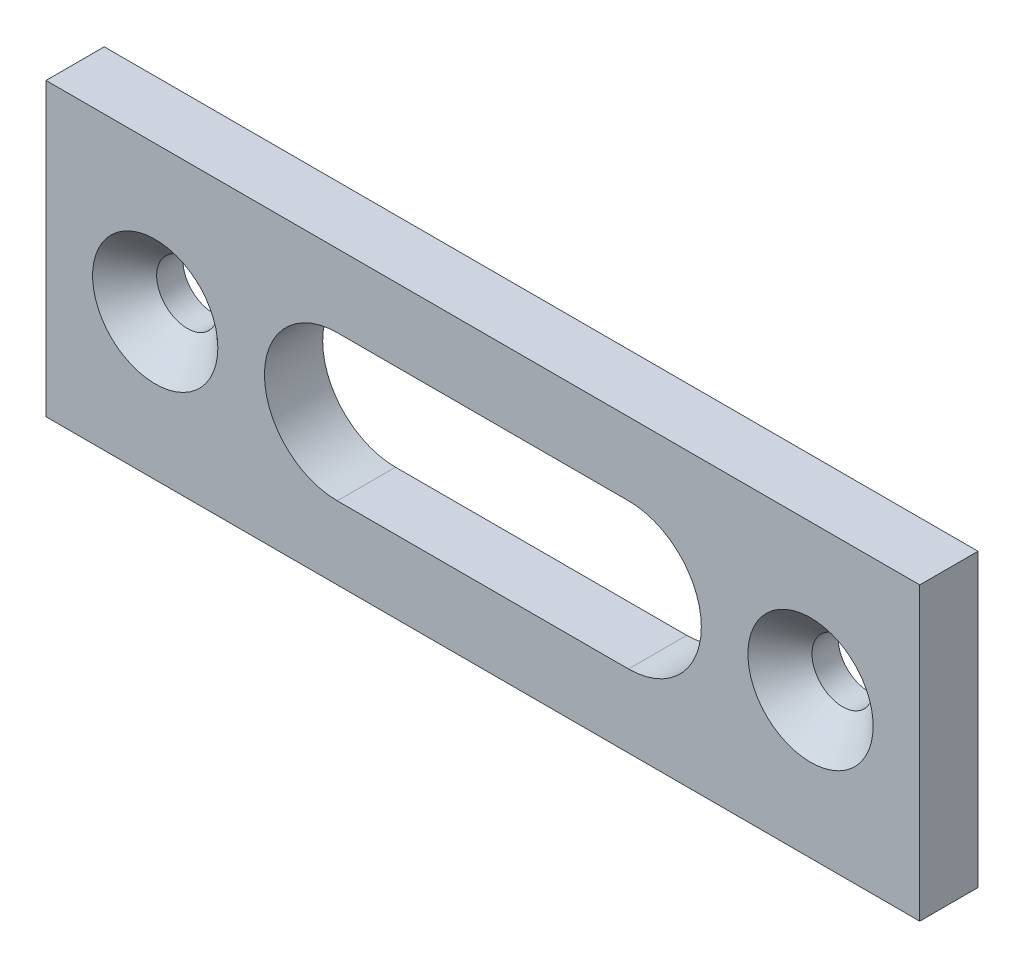
ISO-10303-21;
HEADER;
FILE_DESCRIPTION(('STEP AP214'),'2;1');
FILE_NAME('part.step','',(''),(''),'','','');
FILE_SCHEMA(('AUTOMOTIVE_DESIGN { 1 0 10303 214 1 1 1 1 }'));
ENDSEC;
DATA;
#1=APPLICATION_CONTEXT('core data for automotive mechanical design processes');
#2=APPLICATION_PROTOCOL_DEFINITION('international standard','automotive_design',2000,#1);
#3=PRODUCT_CONTEXT('',#1,'mechanical');
#4=PRODUCT('Part','Part','',(#3));
#5=PRODUCT_RELATED_PRODUCT_CATEGORY('part','',(#4));
#6=PRODUCT_DEFINITION_FORMATION('','',#4);
#7=PRODUCT_DEFINITION_CONTEXT('part definition',#1,'design');
#8=PRODUCT_DEFINITION('design','',#6,#7);
#9=PRODUCT_DEFINITION_SHAPE('','',#8);
#10=(LENGTH_UNIT() NAMED_UNIT(*) SI_UNIT(.MILLI.,.METRE.));
#11=(NAMED_UNIT(*) PLANE_ANGLE_UNIT() SI_UNIT($,.RADIAN.));
#12=(NAMED_UNIT(*) SI_UNIT($,.STERADIAN.) SOLID_ANGLE_UNIT());
#13=UNCERTAINTY_MEASURE_WITH_UNIT(LENGTH_MEASURE(1.E-05),#10,'distance_accuracy_value','');
#14=(GEOMETRIC_REPRESENTATION_CONTEXT(3) GLOBAL_UNCERTAINTY_ASSIGNED_CONTEXT((#13)) GLOBAL_UNIT_ASSIGNED_CONTEXT((#10,
#11,#12)) REPRESENTATION_CONTEXT('',''));
#15=CARTESIAN_POINT('',(0.,0.,0.));
#16=DIRECTION('',(0.,0.,1.));
#17=DIRECTION('',(1.,0.,0.));
#18=AXIS2_PLACEMENT_3D('',#15,#16,#17);
#19=CARTESIAN_POINT('',(-30.,-10.,4.));
#20=DIRECTION('',(0.,0.,1.));
#21=DIRECTION('',(1.,0.,0.));
#22=AXIS2_PLACEMENT_3D('',#19,#20,#21);
#23=PLANE('',#22);
#24=CARTESIAN_POINT('',(22.5,0.,4.));
#25=DIRECTION('',(0.,0.,1.));
#26=DIRECTION('',(1.,0.,0.));
#27=AXIS2_PLACEMENT_3D('',#24,#25,#26);
#28=CIRCLE('',#27,4.30000000000001);
#29=CARTESIAN_POINT('',(26.8,0.,4.));
#30=VERTEX_POINT('',#29);
#31=EDGE_CURVE('E34',#30,#30,#28,.F.);
#32=ORIENTED_EDGE('',*,*,#31,.T.);
#33=EDGE_LOOP('',(#32));
#34=FACE_BOUND('',#33,.T.);
#35=CARTESIAN_POINT('',(-22.5,0.,4.));
#36=DIRECTION('',(0.,0.,1.));
#37=DIRECTION('',(1.,0.,0.));
#38=AXIS2_PLACEMENT_3D('',#35,#36,#37);
#39=CIRCLE('',#38,4.30000000000001);
#40=CARTESIAN_POINT('',(-18.2,0.,4.));
#41=VERTEX_POINT('',#40);
#42=EDGE_CURVE('E165',#41,#41,#39,.F.);
#43=ORIENTED_EDGE('',*,*,#42,.T.);
#44=EDGE_LOOP('',(#43));
#45=FACE_BOUND('',#44,.T.);
#46=DIRECTION('',(0.,-1.,0.));
#47=VECTOR('',#46,1.);
#48=CARTESIAN_POINT('',(-30.,9.99999999999999,4.));
#49=LINE('',#48,#47);
#50=CARTESIAN_POINT('',(-30.,9.99999999999999,4.));
#51=VERTEX_POINT('',#50);
#52=CARTESIAN_POINT('',(-30.,-10.,4.));
#53=VERTEX_POINT('',#52);
#54=EDGE_CURVE('E141',#51,#53,#49,.T.);
#55=ORIENTED_EDGE('',*,*,#54,.T.);
#56=DIRECTION('',(1.,0.,0.));
#57=VECTOR('',#56,1.);
#58=CARTESIAN_POINT('',(-30.,-10.,4.));
#59=LINE('',#58,#57);
#60=CARTESIAN_POINT('',(30.,-9.99999999999999,4.));
#61=VERTEX_POINT('',#60);
#62=EDGE_CURVE('E144',#53,#61,#59,.T.);
#63=ORIENTED_EDGE('',*,*,#62,.T.);
#64=DIRECTION('',(0.,1.,0.));
#65=VECTOR('',#64,1.);
#66=CARTESIAN_POINT('',(30.,10.,4.));
#67=LINE('',#66,#65);
#68=CARTESIAN_POINT('',(30.,10.,4.));
#69=VERTEX_POINT('',#68);
#70=EDGE_CURVE('E146',#61,#69,#67,.T.);
#71=ORIENTED_EDGE('',*,*,#70,.T.);
#72=DIRECTION('',(-1.,0.,0.));
#73=VECTOR('',#72,1.);
#74=CARTESIAN_POINT('',(-30.,9.99999999999999,4.));
#75=LINE('',#74,#73);
#76=EDGE_CURVE('E148',#69,#51,#75,.T.);
#77=ORIENTED_EDGE('',*,*,#76,.T.);
#78=EDGE_LOOP('',(#55,#63,#71,#77));
#79=FACE_BOUND('',#78,.T.);
#80=DIRECTION('',(1.,0.,0.));
#81=VECTOR('',#80,1.);
#82=CARTESIAN_POINT('',(-9.99999999999999,-5.,4.));
#83=LINE('',#82,#81);
#84=CARTESIAN_POINT('',(-9.99999999999999,-5.,4.));
#85=VERTEX_POINT('',#84);
#86=CARTESIAN_POINT('',(10.,-5.,4.));
#87=VERTEX_POINT('',#86);
#88=EDGE_CURVE('E117',#85,#87,#83,.T.);
#89=ORIENTED_EDGE('',*,*,#88,.F.);
#90=CARTESIAN_POINT('',(-9.99999999999999,0.,4.));
#91=DIRECTION('',(0.,0.,1.));
#92=DIRECTION('',(1.,0.,0.));
#93=AXIS2_PLACEMENT_3D('',#90,#91,#92);
#94=CIRCLE('',#93,5.);
#95=CARTESIAN_POINT('',(-9.99999999999999,5.,4.));
#96=VERTEX_POINT('',#95);
#97=EDGE_CURVE('E106',#96,#85,#94,.T.);
#98=ORIENTED_EDGE('',*,*,#97,.F.);
#99=DIRECTION('',(-1.,0.,0.));
#100=VECTOR('',#99,1.);
#101=CARTESIAN_POINT('',(-9.99999999999999,5.,4.));
#102=LINE('',#101,#100);
#103=CARTESIAN_POINT('',(10.,5.,4.));
#104=VERTEX_POINT('',#103);
#105=EDGE_CURVE('E121',#104,#96,#102,.T.);
#106=ORIENTED_EDGE('',*,*,#105,.F.);
#107=CARTESIAN_POINT('',(10.,0.,4.));
#108=DIRECTION('',(0.,0.,1.));
#109=DIRECTION('',(1.,0.,0.));
#110=AXIS2_PLACEMENT_3D('',#107,#108,#109);
#111=CIRCLE('',#110,5.);
#112=EDGE_CURVE('E119',#87,#104,#111,.T.);
#113=ORIENTED_EDGE('',*,*,#112,.F.);
#114=EDGE_LOOP('',(#89,#98,#106,#113));
#115=FACE_BOUND('',#114,.T.);
#116=ADVANCED_FACE('F26',(#34,#45,#79,#115),#23,.T.);
#117=CARTESIAN_POINT('',(-30.,-10.,0.));
#118=DIRECTION('',(0.,0.,1.));
#119=DIRECTION('',(1.,0.,0.));
#120=AXIS2_PLACEMENT_3D('',#117,#118,#119);
#121=PLANE('',#120);
#122=CARTESIAN_POINT('',(22.5,0.,0.));
#123=DIRECTION('',(0.,0.,1.));
#124=DIRECTION('',(1.,0.,0.));
#125=AXIS2_PLACEMENT_3D('',#122,#123,#124);
#126=CIRCLE('',#125,2.1);
#127=CARTESIAN_POINT('',(24.6,0.,0.));
#128=VERTEX_POINT('',#127);
#129=EDGE_CURVE('E107',#128,#128,#126,.T.);
#130=ORIENTED_EDGE('',*,*,#129,.T.);
#131=EDGE_LOOP('',(#130));
#132=FACE_BOUND('',#131,.T.);
#133=DIRECTION('',(0.,-1.,0.));
#134=VECTOR('',#133,1.);
#135=CARTESIAN_POINT('',(-30.,9.99999999999999,0.));
#136=LINE('',#135,#134);
#137=CARTESIAN_POINT('',(-30.,9.99999999999999,0.));
#138=VERTEX_POINT('',#137);
#139=CARTESIAN_POINT('',(-30.,-10.,0.));
#140=VERTEX_POINT('',#139);
#141=EDGE_CURVE('E132',#138,#140,#136,.T.);
#142=ORIENTED_EDGE('',*,*,#141,.F.);
#143=DIRECTION('',(-1.,0.,0.));
#144=VECTOR('',#143,1.);
#145=CARTESIAN_POINT('',(-30.,9.99999999999999,0.));
#146=LINE('',#145,#144);
#147=CARTESIAN_POINT('',(30.,10.,0.));
#148=VERTEX_POINT('',#147);
#149=EDGE_CURVE('E139',#148,#138,#146,.T.);
#150=ORIENTED_EDGE('',*,*,#149,.F.);
#151=DIRECTION('',(0.,1.,0.));
#152=VECTOR('',#151,1.);
#153=CARTESIAN_POINT('',(30.,10.,0.));
#154=LINE('',#153,#152);
#155=CARTESIAN_POINT('',(30.,-9.99999999999999,0.));
#156=VERTEX_POINT('',#155);
#157=EDGE_CURVE('E137',#156,#148,#154,.T.);
#158=ORIENTED_EDGE('',*,*,#157,.F.);
#159=DIRECTION('',(1.,0.,0.));
#160=VECTOR('',#159,1.);
#161=CARTESIAN_POINT('',(-30.,-10.,0.));
#162=LINE('',#161,#160);
#163=EDGE_CURVE('E135',#140,#156,#162,.T.);
#164=ORIENTED_EDGE('',*,*,#163,.F.);
#165=EDGE_LOOP('',(#142,#150,#158,#164));
#166=FACE_BOUND('',#165,.T.);
#167=CARTESIAN_POINT('',(-22.5,0.,0.));
#168=DIRECTION('',(0.,0.,1.));
#169=DIRECTION('',(1.,0.,0.));
#170=AXIS2_PLACEMENT_3D('',#167,#168,#169);
#171=CIRCLE('',#170,2.1);
#172=CARTESIAN_POINT('',(-20.4,0.,0.));
#173=VERTEX_POINT('',#172);
#174=EDGE_CURVE('E129',#173,#173,#171,.T.);
#175=ORIENTED_EDGE('',*,*,#174,.T.);
#176=EDGE_LOOP('',(#175));
#177=FACE_BOUND('',#176,.T.);
#178=CARTESIAN_POINT('',(-9.99999999999999,0.,0.));
#179=DIRECTION('',(0.,0.,1.));
#180=DIRECTION('',(1.,0.,0.));
#181=AXIS2_PLACEMENT_3D('',#178,#179,#180);
#182=CIRCLE('',#181,5.);
#183=CARTESIAN_POINT('',(-9.99999999999999,5.,0.));
#184=VERTEX_POINT('',#183);
#185=CARTESIAN_POINT('',(-9.99999999999999,-5.,0.));
#186=VERTEX_POINT('',#185);
#187=EDGE_CURVE('E49',#184,#186,#182,.T.);
#188=ORIENTED_EDGE('',*,*,#187,.T.);
#189=DIRECTION('',(1.,0.,0.));
#190=VECTOR('',#189,1.);
#191=CARTESIAN_POINT('',(-9.99999999999999,-5.,0.));
#192=LINE('',#191,#190);
#193=CARTESIAN_POINT('',(10.,-5.,0.));
#194=VERTEX_POINT('',#193);
#195=EDGE_CURVE('E93',#186,#194,#192,.T.);
#196=ORIENTED_EDGE('',*,*,#195,.T.);
#197=CARTESIAN_POINT('',(10.,0.,0.));
#198=DIRECTION('',(0.,0.,1.));
#199=DIRECTION('',(1.,0.,0.));
#200=AXIS2_PLACEMENT_3D('',#197,#198,#199);
#201=CIRCLE('',#200,5.);
#202=CARTESIAN_POINT('',(10.,5.,0.));
#203=VERTEX_POINT('',#202);
#204=EDGE_CURVE('E102',#194,#203,#201,.T.);
#205=ORIENTED_EDGE('',*,*,#204,.T.);
#206=DIRECTION('',(-1.,0.,0.));
#207=VECTOR('',#206,1.);
#208=CARTESIAN_POINT('',(-9.99999999999999,5.,0.));
#209=LINE('',#208,#207);
#210=EDGE_CURVE('E111',#203,#184,#209,.T.);
#211=ORIENTED_EDGE('',*,*,#210,.T.);
#212=EDGE_LOOP('',(#188,#196,#205,#211));
#213=FACE_BOUND('',#212,.T.);
#214=ADVANCED_FACE('F110',(#132,#166,#177,#213),#121,.F.);
#215=CARTESIAN_POINT('',(-30.,9.99999999999999,4.));
#216=DIRECTION('',(1.,0.,0.));
#217=DIRECTION('',(0.,1.,0.));
#218=AXIS2_PLACEMENT_3D('',#215,#216,#217);
#219=PLANE('',#218);
#220=ORIENTED_EDGE('',*,*,#141,.T.);
#221=DIRECTION('',(0.,0.,-1.));
#222=VECTOR('',#221,1.);
#223=CARTESIAN_POINT('',(-30.,-10.,4.));
#224=LINE('',#223,#222);
#225=EDGE_CURVE('E159',#53,#140,#224,.T.);
#226=ORIENTED_EDGE('',*,*,#225,.F.);
#227=ORIENTED_EDGE('',*,*,#54,.F.);
#228=DIRECTION('',(0.,0.,-1.));
#229=VECTOR('',#228,1.);
#230=CARTESIAN_POINT('',(-30.,9.99999999999999,4.));
#231=LINE('',#230,#229);
#232=EDGE_CURVE('E150',#51,#138,#231,.T.);
#233=ORIENTED_EDGE('',*,*,#232,.T.);
#234=EDGE_LOOP('',(#220,#226,#227,#233));
#235=FACE_BOUND('',#234,.T.);
#236=ADVANCED_FACE('F28',(#235),#219,.F.);
#237=CARTESIAN_POINT('',(-30.,-10.,4.));
#238=DIRECTION('',(0.,1.,0.));
#239=DIRECTION('',(-1.,0.,0.));
#240=AXIS2_PLACEMENT_3D('',#237,#238,#239);
#241=PLANE('',#240);
#242=ORIENTED_EDGE('',*,*,#163,.T.);
#243=DIRECTION('',(0.,0.,-1.));
#244=VECTOR('',#243,1.);
#245=CARTESIAN_POINT('',(30.,-9.99999999999999,4.));
#246=LINE('',#245,#244);
#247=EDGE_CURVE('E156',#61,#156,#246,.T.);
#248=ORIENTED_EDGE('',*,*,#247,.F.);
#249=ORIENTED_EDGE('',*,*,#62,.F.);
#250=ORIENTED_EDGE('',*,*,#225,.T.);
#251=EDGE_LOOP('',(#242,#248,#249,#250));
#252=FACE_BOUND('',#251,.T.);
#253=ADVANCED_FACE('F212',(#252),#241,.F.);
#254=CARTESIAN_POINT('',(30.,10.,4.));
#255=DIRECTION('',(-1.,0.,0.));
#256=DIRECTION('',(0.,-1.,0.));
#257=AXIS2_PLACEMENT_3D('',#254,#255,#256);
#258=PLANE('',#257);
#259=ORIENTED_EDGE('',*,*,#157,.T.);
#260=DIRECTION('',(0.,0.,-1.));
#261=VECTOR('',#260,1.);
#262=CARTESIAN_POINT('',(30.,10.,4.));
#263=LINE('',#262,#261);
#264=EDGE_CURVE('E153',#69,#148,#263,.T.);
#265=ORIENTED_EDGE('',*,*,#264,.F.);
#266=ORIENTED_EDGE('',*,*,#70,.F.);
#267=ORIENTED_EDGE('',*,*,#247,.T.);
#268=EDGE_LOOP('',(#259,#265,#266,#267));
#269=FACE_BOUND('',#268,.T.);
#270=ADVANCED_FACE('F203',(#269),#258,.F.);
#271=CARTESIAN_POINT('',(-30.,9.99999999999999,4.));
#272=DIRECTION('',(0.,-1.,0.));
#273=DIRECTION('',(1.,0.,0.));
#274=AXIS2_PLACEMENT_3D('',#271,#272,#273);
#275=PLANE('',#274);
#276=ORIENTED_EDGE('',*,*,#149,.T.);
#277=ORIENTED_EDGE('',*,*,#232,.F.);
#278=ORIENTED_EDGE('',*,*,#76,.F.);
#279=ORIENTED_EDGE('',*,*,#264,.T.);
#280=EDGE_LOOP('',(#276,#277,#278,#279));
#281=FACE_BOUND('',#280,.T.);
#282=ADVANCED_FACE('F196',(#281),#275,.F.);
#283=CARTESIAN_POINT('',(-22.5,0.,4.));
#284=DIRECTION('',(0.,0.,-1.));
#285=DIRECTION('',(-1.,0.,0.));
#286=AXIS2_PLACEMENT_3D('',#283,#284,#285);
#287=CYLINDRICAL_SURFACE('',#286,2.1);
#288=CARTESIAN_POINT('',(-22.5,0.,1.8));
#289=DIRECTION('',(0.,0.,1.));
#290=DIRECTION('',(1.,0.,0.));
#291=AXIS2_PLACEMENT_3D('',#288,#289,#290);
#292=CIRCLE('',#291,2.1);
#293=CARTESIAN_POINT('',(-20.4,0.,1.8));
#294=VERTEX_POINT('',#293);
#295=EDGE_CURVE('E11',#294,#294,#292,.T.);
#296=ORIENTED_EDGE('',*,*,#295,.T.);
#297=EDGE_LOOP('',(#296));
#298=FACE_BOUND('',#297,.T.);
#299=ORIENTED_EDGE('',*,*,#174,.F.);
#300=EDGE_LOOP('',(#299));
#301=FACE_BOUND('',#300,.T.);
#302=ADVANCED_FACE('F183',(#298,#301),#287,.F.);
#303=CARTESIAN_POINT('',(22.5,0.,4.));
#304=DIRECTION('',(0.,0.,-1.));
#305=DIRECTION('',(-1.,0.,0.));
#306=AXIS2_PLACEMENT_3D('',#303,#304,#305);
#307=CYLINDRICAL_SURFACE('',#306,2.1);
#308=CARTESIAN_POINT('',(22.5,0.,1.8));
#309=DIRECTION('',(0.,0.,1.));
#310=DIRECTION('',(1.,0.,0.));
#311=AXIS2_PLACEMENT_3D('',#308,#309,#310);
#312=CIRCLE('',#311,2.1);
#313=CARTESIAN_POINT('',(24.6,0.,1.8));
#314=VERTEX_POINT('',#313);
#315=EDGE_CURVE('E162',#314,#314,#312,.T.);
#316=ORIENTED_EDGE('',*,*,#315,.T.);
#317=EDGE_LOOP('',(#316));
#318=FACE_BOUND('',#317,.T.);
#319=ORIENTED_EDGE('',*,*,#129,.F.);
#320=EDGE_LOOP('',(#319));
#321=FACE_BOUND('',#320,.T.);
#322=ADVANCED_FACE('F180',(#318,#321),#307,.F.);
#323=CARTESIAN_POINT('',(-9.99999999999999,0.,4.));
#324=DIRECTION('',(0.,0.,-1.));
#325=DIRECTION('',(-1.,0.,0.));
#326=AXIS2_PLACEMENT_3D('',#323,#324,#325);
#327=CYLINDRICAL_SURFACE('',#326,5.);
#328=ORIENTED_EDGE('',*,*,#187,.F.);
#329=DIRECTION('',(0.,0.,-1.));
#330=VECTOR('',#329,1.);
#331=CARTESIAN_POINT('',(-9.99999999999999,5.,4.));
#332=LINE('',#331,#330);
#333=EDGE_CURVE('E123',#96,#184,#332,.T.);
#334=ORIENTED_EDGE('',*,*,#333,.F.);
#335=ORIENTED_EDGE('',*,*,#97,.T.);
#336=DIRECTION('',(0.,0.,-1.));
#337=VECTOR('',#336,1.);
#338=CARTESIAN_POINT('',(-9.99999999999999,-5.,4.));
#339=LINE('',#338,#337);
#340=EDGE_CURVE('E95',#85,#186,#339,.T.);
#341=ORIENTED_EDGE('',*,*,#340,.T.);
#342=EDGE_LOOP('',(#328,#334,#335,#341));
#343=FACE_BOUND('',#342,.T.);
#344=ADVANCED_FACE('F104',(#343),#327,.F.);
#345=CARTESIAN_POINT('',(-9.99999999999999,-5.,4.));
#346=DIRECTION('',(0.,1.,0.));
#347=DIRECTION('',(-1.,0.,0.));
#348=AXIS2_PLACEMENT_3D('',#345,#346,#347);
#349=PLANE('',#348);
#350=ORIENTED_EDGE('',*,*,#195,.F.);
#351=ORIENTED_EDGE('',*,*,#340,.F.);
#352=ORIENTED_EDGE('',*,*,#88,.T.);
#353=DIRECTION('',(0.,0.,-1.));
#354=VECTOR('',#353,1.);
#355=CARTESIAN_POINT('',(10.,-5.,4.));
#356=LINE('',#355,#354);
#357=EDGE_CURVE('E98',#87,#194,#356,.T.);
#358=ORIENTED_EDGE('',*,*,#357,.T.);
#359=EDGE_LOOP('',(#350,#351,#352,#358));
#360=FACE_BOUND('',#359,.T.);
#361=ADVANCED_FACE('F94',(#360),#349,.T.);
#362=CARTESIAN_POINT('',(10.,0.,4.));
#363=DIRECTION('',(0.,0.,-1.));
#364=DIRECTION('',(-1.,0.,0.));
#365=AXIS2_PLACEMENT_3D('',#362,#363,#364);
#366=CYLINDRICAL_SURFACE('',#365,5.);
#367=ORIENTED_EDGE('',*,*,#204,.F.);
#368=ORIENTED_EDGE('',*,*,#357,.F.);
#369=ORIENTED_EDGE('',*,*,#112,.T.);
#370=DIRECTION('',(0.,0.,-1.));
#371=VECTOR('',#370,1.);
#372=CARTESIAN_POINT('',(10.,5.,4.));
#373=LINE('',#372,#371);
#374=EDGE_CURVE('E41',#104,#203,#373,.T.);
#375=ORIENTED_EDGE('',*,*,#374,.T.);
#376=EDGE_LOOP('',(#367,#368,#369,#375));
#377=FACE_BOUND('',#376,.T.);
#378=ADVANCED_FACE('F233',(#377),#366,.F.);
#379=CARTESIAN_POINT('',(-9.99999999999999,5.,4.));
#380=DIRECTION('',(0.,-1.,0.));
#381=DIRECTION('',(1.,0.,0.));
#382=AXIS2_PLACEMENT_3D('',#379,#380,#381);
#383=PLANE('',#382);
#384=ORIENTED_EDGE('',*,*,#210,.F.);
#385=ORIENTED_EDGE('',*,*,#374,.F.);
#386=ORIENTED_EDGE('',*,*,#105,.T.);
#387=ORIENTED_EDGE('',*,*,#333,.T.);
#388=EDGE_LOOP('',(#384,#385,#386,#387));
#389=FACE_BOUND('',#388,.T.);
#390=ADVANCED_FACE('F176',(#389),#383,.T.);
#391=CARTESIAN_POINT('',(22.5,0.,1.8));
#392=DIRECTION('',(0.,0.,1.));
#393=DIRECTION('',(1.,0.,0.));
#394=AXIS2_PLACEMENT_3D('',#391,#392,#393);
#395=CONICAL_SURFACE('',#394,2.1,0.78539816339745);
#396=ORIENTED_EDGE('',*,*,#31,.F.);
#397=EDGE_LOOP('',(#396));
#398=FACE_BOUND('',#397,.T.);
#399=ORIENTED_EDGE('',*,*,#315,.F.);
#400=EDGE_LOOP('',(#399));
#401=FACE_BOUND('',#400,.T.);
#402=ADVANCED_FACE('F172',(#398,#401),#395,.F.);
#403=CARTESIAN_POINT('',(-22.5,0.,1.8));
#404=DIRECTION('',(0.,0.,1.));
#405=DIRECTION('',(1.,0.,0.));
#406=AXIS2_PLACEMENT_3D('',#403,#404,#405);
#407=CONICAL_SURFACE('',#406,2.1,0.78539816339745);
#408=ORIENTED_EDGE('',*,*,#42,.F.);
#409=EDGE_LOOP('',(#408));
#410=FACE_BOUND('',#409,.T.);
#411=ORIENTED_EDGE('',*,*,#295,.F.);
#412=EDGE_LOOP('',(#411));
#413=FACE_BOUND('',#412,.T.);
#414=ADVANCED_FACE('F175',(#410,#413),#407,.F.);
#415=CLOSED_SHELL('',(#116,#214,#236,#253,#270,#282,#302,#322,#344,#361,#378,#390,#402,#414));
#416=MANIFOLD_SOLID_BREP('B2',#415);
#417=ADVANCED_BREP_SHAPE_REPRESENTATION('',(#18,#416),#14);
#418=SHAPE_DEFINITION_REPRESENTATION(#9,#417);
ENDSEC;
END-ISO-10303-21;
